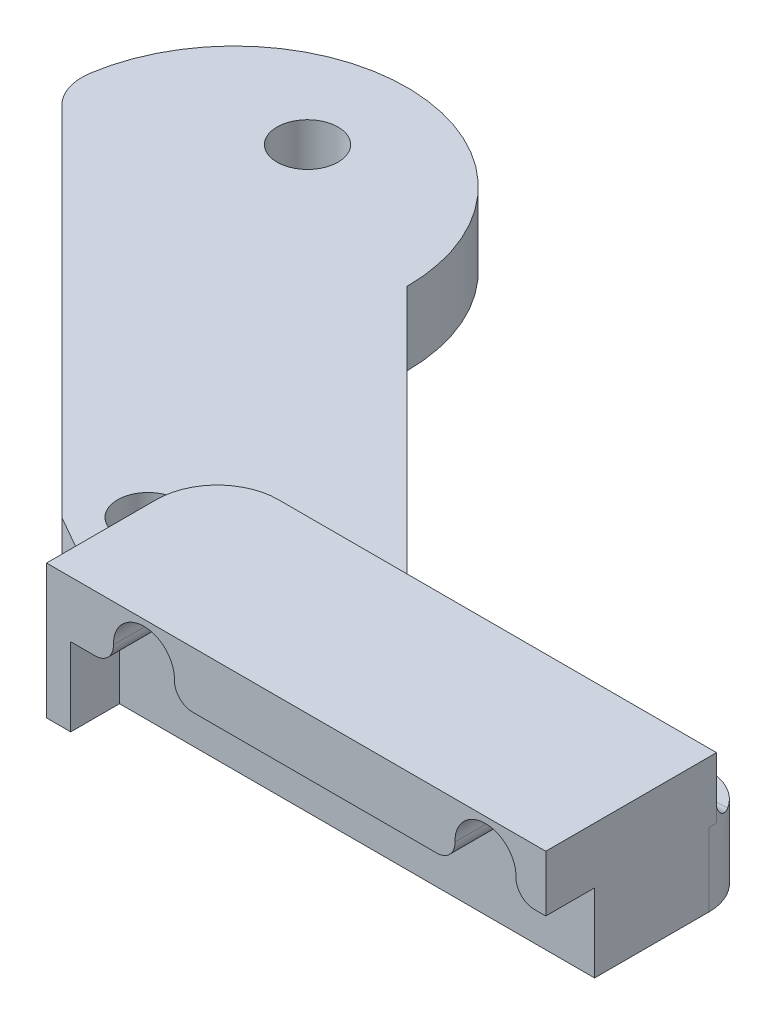
ISO-10303-21;
HEADER;
FILE_DESCRIPTION(('STEP AP214'),'2;1');
FILE_NAME('part.step','',(''),(''),'','','');
FILE_SCHEMA(('AUTOMOTIVE_DESIGN { 1 0 10303 214 1 1 1 1 }'));
ENDSEC;
DATA;
#1=APPLICATION_CONTEXT('core data for automotive mechanical design processes');
#2=APPLICATION_PROTOCOL_DEFINITION('international standard','automotive_design',2000,#1);
#3=PRODUCT_CONTEXT('',#1,'mechanical');
#4=PRODUCT('Part','Part','',(#3));
#5=PRODUCT_RELATED_PRODUCT_CATEGORY('part','',(#4));
#6=PRODUCT_DEFINITION_FORMATION('','',#4);
#7=PRODUCT_DEFINITION_CONTEXT('part definition',#1,'design');
#8=PRODUCT_DEFINITION('design','',#6,#7);
#9=PRODUCT_DEFINITION_SHAPE('','',#8);
#10=(LENGTH_UNIT() NAMED_UNIT(*) SI_UNIT(.MILLI.,.METRE.));
#11=(NAMED_UNIT(*) PLANE_ANGLE_UNIT() SI_UNIT($,.RADIAN.));
#12=(NAMED_UNIT(*) SI_UNIT($,.STERADIAN.) SOLID_ANGLE_UNIT());
#13=UNCERTAINTY_MEASURE_WITH_UNIT(LENGTH_MEASURE(1.E-05),#10,'distance_accuracy_value','');
#14=(GEOMETRIC_REPRESENTATION_CONTEXT(3) GLOBAL_UNCERTAINTY_ASSIGNED_CONTEXT((#13)) GLOBAL_UNIT_ASSIGNED_CONTEXT((#10,
#11,#12)) REPRESENTATION_CONTEXT('',''));
#15=CARTESIAN_POINT('',(0.,0.,0.));
#16=DIRECTION('',(0.,0.,1.));
#17=DIRECTION('',(1.,0.,0.));
#18=AXIS2_PLACEMENT_3D('',#15,#16,#17);
#19=CARTESIAN_POINT('',(0.,3.81,10.668));
#20=DIRECTION('',(0.,0.,-1.));
#21=DIRECTION('',(-1.,0.,0.));
#22=AXIS2_PLACEMENT_3D('',#19,#20,#21);
#23=PLANE('',#22);
#24=CARTESIAN_POINT('',(50.8759481826122,6.35,10.668));
#25=DIRECTION('',(0.,0.,1.));
#26=DIRECTION('',(1.,0.,0.));
#27=AXIS2_PLACEMENT_3D('',#24,#25,#26);
#28=CIRCLE('',#27,2.28599999999999);
#29=CARTESIAN_POINT('',(53.1619481826122,6.35,10.668));
#30=VERTEX_POINT('',#29);
#31=EDGE_CURVE('E322',#30,#30,#28,.T.);
#32=ORIENTED_EDGE('',*,*,#31,.F.);
#33=EDGE_LOOP('',(#32));
#34=FACE_BOUND('',#33,.T.);
#35=CARTESIAN_POINT('',(15.3159481826123,6.35,10.668));
#36=DIRECTION('',(0.,0.,1.));
#37=DIRECTION('',(1.,0.,0.));
#38=AXIS2_PLACEMENT_3D('',#35,#36,#37);
#39=CIRCLE('',#38,2.286);
#40=CARTESIAN_POINT('',(17.6019481826123,6.35,10.668));
#41=VERTEX_POINT('',#40);
#42=EDGE_CURVE('E318',#41,#41,#39,.T.);
#43=ORIENTED_EDGE('',*,*,#42,.F.);
#44=EDGE_LOOP('',(#43));
#45=FACE_BOUND('',#44,.T.);
#46=DIRECTION('',(1.,0.,0.));
#47=VECTOR('',#46,1.);
#48=CARTESIAN_POINT('',(0.,4.318,10.668));
#49=LINE('',#48,#47);
#50=CARTESIAN_POINT('',(55.9543604344878,4.318,10.668));
#51=VERTEX_POINT('',#50);
#52=CARTESIAN_POINT('',(57.15,4.318,10.668));
#53=VERTEX_POINT('',#52);
#54=EDGE_CURVE('E296',#51,#53,#49,.T.);
#55=ORIENTED_EDGE('',*,*,#54,.F.);
#56=CARTESIAN_POINT('',(55.9543604344878,6.223,10.668));
#57=DIRECTION('',(0.,0.,-1.));
#58=DIRECTION('',(-1.,0.,0.));
#59=AXIS2_PLACEMENT_3D('',#56,#57,#58);
#60=CIRCLE('',#59,1.905);
#61=CARTESIAN_POINT('',(54.0499558400345,6.270625,10.668));
#62=VERTEX_POINT('',#61);
#63=EDGE_CURVE('E514',#51,#62,#60,.T.);
#64=ORIENTED_EDGE('',*,*,#63,.T.);
#65=CARTESIAN_POINT('',(50.8759481826122,6.35,10.668));
#66=DIRECTION('',(0.,0.,1.));
#67=DIRECTION('',(1.,0.,0.));
#68=AXIS2_PLACEMENT_3D('',#65,#66,#67);
#69=CIRCLE('',#68,3.175);
#70=CARTESIAN_POINT('',(47.70194052519,6.270625,10.668));
#71=VERTEX_POINT('',#70);
#72=EDGE_CURVE('E292',#62,#71,#69,.T.);
#73=ORIENTED_EDGE('',*,*,#72,.T.);
#74=CARTESIAN_POINT('',(45.7975359307367,6.223,10.668));
#75=DIRECTION('',(0.,0.,-1.));
#76=DIRECTION('',(-1.,0.,0.));
#77=AXIS2_PLACEMENT_3D('',#74,#75,#76);
#78=CIRCLE('',#77,1.905);
#79=CARTESIAN_POINT('',(45.7975359307367,4.318,10.668));
#80=VERTEX_POINT('',#79);
#81=EDGE_CURVE('E517',#71,#80,#78,.T.);
#82=ORIENTED_EDGE('',*,*,#81,.T.);
#83=CARTESIAN_POINT('',(20.3943604344878,4.318,10.668));
#84=VERTEX_POINT('',#83);
#85=EDGE_CURVE('E276',#84,#80,#49,.T.);
#86=ORIENTED_EDGE('',*,*,#85,.F.);
#87=CARTESIAN_POINT('',(20.3943604344878,6.223,10.668));
#88=DIRECTION('',(0.,0.,-1.));
#89=DIRECTION('',(-1.,0.,0.));
#90=AXIS2_PLACEMENT_3D('',#87,#88,#89);
#91=CIRCLE('',#90,1.905);
#92=CARTESIAN_POINT('',(18.4899558400345,6.270625,10.668));
#93=VERTEX_POINT('',#92);
#94=EDGE_CURVE('E520',#84,#93,#91,.T.);
#95=ORIENTED_EDGE('',*,*,#94,.T.);
#96=CARTESIAN_POINT('',(15.3159481826123,6.35,10.668));
#97=DIRECTION('',(0.,0.,1.));
#98=DIRECTION('',(1.,0.,0.));
#99=AXIS2_PLACEMENT_3D('',#96,#97,#98);
#100=CIRCLE('',#99,3.175);
#101=CARTESIAN_POINT('',(12.14194052519,6.270625,10.668));
#102=VERTEX_POINT('',#101);
#103=EDGE_CURVE('E300',#93,#102,#100,.T.);
#104=ORIENTED_EDGE('',*,*,#103,.T.);
#105=CARTESIAN_POINT('',(10.2375359307367,6.223,10.668));
#106=DIRECTION('',(0.,0.,-1.));
#107=DIRECTION('',(-1.,0.,0.));
#108=AXIS2_PLACEMENT_3D('',#105,#106,#107);
#109=CIRCLE('',#108,1.905);
#110=CARTESIAN_POINT('',(10.2375359307367,4.318,10.668));
#111=VERTEX_POINT('',#110);
#112=EDGE_CURVE('E523',#102,#111,#109,.T.);
#113=ORIENTED_EDGE('',*,*,#112,.T.);
#114=CARTESIAN_POINT('',(7.69594818261226,4.318,10.668));
#115=VERTEX_POINT('',#114);
#116=EDGE_CURVE('E301',#115,#111,#49,.T.);
#117=ORIENTED_EDGE('',*,*,#116,.F.);
#118=DIRECTION('',(0.,-1.,0.));
#119=VECTOR('',#118,1.);
#120=CARTESIAN_POINT('',(7.69594818261226,3.81,10.668));
#121=LINE('',#120,#119);
#122=CARTESIAN_POINT('',(7.69594818261226,-3.81,10.668));
#123=VERTEX_POINT('',#122);
#124=EDGE_CURVE('E455',#115,#123,#121,.T.);
#125=ORIENTED_EDGE('',*,*,#124,.T.);
#126=DIRECTION('',(1.,0.,0.));
#127=VECTOR('',#126,1.);
#128=CARTESIAN_POINT('',(0.,-3.81,10.668));
#129=LINE('',#128,#127);
#130=CARTESIAN_POINT('',(57.15,-3.81,10.668));
#131=VERTEX_POINT('',#130);
#132=EDGE_CURVE('E397',#123,#131,#129,.T.);
#133=ORIENTED_EDGE('',*,*,#132,.T.);
#134=DIRECTION('',(0.,-1.,0.));
#135=VECTOR('',#134,1.);
#136=CARTESIAN_POINT('',(57.15,3.81,10.668));
#137=LINE('',#136,#135);
#138=EDGE_CURVE('E421',#53,#131,#137,.T.);
#139=ORIENTED_EDGE('',*,*,#138,.F.);
#140=EDGE_LOOP('',(#55,#64,#73,#82,#86,#95,#104,#113,#117,#125,#133,#139));
#141=FACE_BOUND('',#140,.T.);
#142=ADVANCED_FACE('F45',(#34,#45,#141),#23,.F.);
#143=CARTESIAN_POINT('',(-4.49012806053458,3.81,4.49012806053458));
#144=DIRECTION('',(-0.707106781186547,0.,0.707106781186548));
#145=DIRECTION('',(0.707106781186548,0.,0.707106781186547));
#146=AXIS2_PLACEMENT_3D('',#143,#144,#145);
#147=PLANE('',#146);
#148=DIRECTION('',(-0.707106781186548,0.,-0.707106781186547));
#149=VECTOR('',#148,1.);
#150=CARTESIAN_POINT('',(-4.49012806053458,3.81,4.49012806053458));
#151=LINE('',#150,#149);
#152=CARTESIAN_POINT('',(-4.49012806053458,3.81,4.49012806053458));
#153=VERTEX_POINT('',#152);
#154=CARTESIAN_POINT('',(-41.6331326972851,3.81,-32.6528765762159));
#155=VERTEX_POINT('',#154);
#156=EDGE_CURVE('E366',#153,#155,#151,.T.);
#157=ORIENTED_EDGE('',*,*,#156,.T.);
#158=DIRECTION('',(0.,-1.,0.));
#159=VECTOR('',#158,1.);
#160=CARTESIAN_POINT('',(-41.6331326972851,3.81,-32.6528765762159));
#161=LINE('',#160,#159);
#162=CARTESIAN_POINT('',(-41.6331326972851,-3.81,-32.6528765762159));
#163=VERTEX_POINT('',#162);
#164=EDGE_CURVE('E461',#155,#163,#161,.T.);
#165=ORIENTED_EDGE('',*,*,#164,.T.);
#166=DIRECTION('',(-0.707106781186548,0.,-0.707106781186547));
#167=VECTOR('',#166,1.);
#168=CARTESIAN_POINT('',(-4.49012806053458,-3.81,4.49012806053458));
#169=LINE('',#168,#167);
#170=CARTESIAN_POINT('',(-4.49012806053458,-3.81,4.49012806053458));
#171=VERTEX_POINT('',#170);
#172=EDGE_CURVE('E362',#171,#163,#169,.T.);
#173=ORIENTED_EDGE('',*,*,#172,.F.);
#174=DIRECTION('',(0.,-1.,0.));
#175=VECTOR('',#174,1.);
#176=CARTESIAN_POINT('',(-4.49012806053458,3.81,4.49012806053458));
#177=LINE('',#176,#175);
#178=EDGE_CURVE('E424',#153,#171,#177,.T.);
#179=ORIENTED_EDGE('',*,*,#178,.F.);
#180=EDGE_LOOP('',(#157,#165,#173,#179));
#181=FACE_BOUND('',#180,.T.);
#182=ADVANCED_FACE('F558',(#181),#147,.T.);
#183=CARTESIAN_POINT('',(-3.03241565510238,3.81,5.32088951603034));
#184=DIRECTION('',(0.49514248555653,0.,-0.868811785714778));
#185=DIRECTION('',(-0.868811785714778,0.,-0.49514248555653));
#186=AXIS2_PLACEMENT_3D('',#183,#184,#185);
#187=PLANE('',#186);
#188=DIRECTION('',(0.868811785714778,0.,0.49514248555653));
#189=VECTOR('',#188,1.);
#190=CARTESIAN_POINT('',(-3.03241565510238,-3.81,5.32088951603034));
#191=LINE('',#190,#189);
#192=CARTESIAN_POINT('',(5.18062435598509,-3.81,10.0015638714311));
#193=VERTEX_POINT('',#192);
#194=EDGE_CURVE('E394',#171,#193,#191,.T.);
#195=ORIENTED_EDGE('',*,*,#194,.T.);
#196=DIRECTION('',(0.,-1.,0.));
#197=VECTOR('',#196,1.);
#198=CARTESIAN_POINT('',(5.18062435598509,3.81,10.0015638714311));
#199=LINE('',#198,#197);
#200=CARTESIAN_POINT('',(5.18062435598509,5.715,10.0015638714311));
#201=VERTEX_POINT('',#200);
#202=EDGE_CURVE('E263',#193,#201,#199,.F.);
#203=ORIENTED_EDGE('',*,*,#202,.T.);
#204=CARTESIAN_POINT('',(3.27562435598509,5.715,8.91588979277068));
#205=DIRECTION('',(0.49514248555653,0.,-0.868811785714778));
#206=DIRECTION('',(0.868811785714778,0.,0.49514248555653));
#207=AXIS2_PLACEMENT_3D('',#204,#205,#206);
#208=ELLIPSE('',#207,2.19264981359886,1.905);
#209=CARTESIAN_POINT('',(3.27562435598509,3.81,8.91588979277068));
#210=VERTEX_POINT('',#209);
#211=EDGE_CURVE('E56',#201,#210,#208,.T.);
#212=ORIENTED_EDGE('',*,*,#211,.T.);
#213=DIRECTION('',(0.868811785714778,0.,0.49514248555653));
#214=VECTOR('',#213,1.);
#215=CARTESIAN_POINT('',(-3.03241565510238,3.81,5.32088951603034));
#216=LINE('',#215,#214);
#217=EDGE_CURVE('E370',#153,#210,#216,.T.);
#218=ORIENTED_EDGE('',*,*,#217,.F.);
#219=ORIENTED_EDGE('',*,*,#178,.T.);
#220=EDGE_LOOP('',(#195,#203,#212,#218,#219));
#221=FACE_BOUND('',#220,.T.);
#222=ADVANCED_FACE('F602',(#221),#187,.F.);
#223=CARTESIAN_POINT('',(57.15,3.81,0.));
#224=DIRECTION('',(1.,0.,0.));
#225=DIRECTION('',(0.,0.,-1.));
#226=AXIS2_PLACEMENT_3D('',#223,#224,#225);
#227=PLANE('',#226);
#228=DIRECTION('',(0.,0.,1.));
#229=VECTOR('',#228,1.);
#230=CARTESIAN_POINT('',(57.15,-3.81,0.));
#231=LINE('',#230,#229);
#232=CARTESIAN_POINT('',(57.15,-3.81,-1.26999999999974));
#233=VERTEX_POINT('',#232);
#234=EDGE_CURVE('E401',#233,#131,#231,.T.);
#235=ORIENTED_EDGE('',*,*,#234,.F.);
#236=DIRECTION('',(0.,-1.,0.));
#237=VECTOR('',#236,1.);
#238=CARTESIAN_POINT('',(57.15,3.81,-1.26999999999974));
#239=LINE('',#238,#237);
#240=CARTESIAN_POINT('',(57.15,3.81,-1.26999999999974));
#241=VERTEX_POINT('',#240);
#242=EDGE_CURVE('E440',#233,#241,#239,.F.);
#243=ORIENTED_EDGE('',*,*,#242,.T.);
#244=DIRECTION('',(0.,0.,-1.));
#245=VECTOR('',#244,1.);
#246=CARTESIAN_POINT('',(57.15,3.81,10.668));
#247=LINE('',#246,#245);
#248=CARTESIAN_POINT('',(57.15,3.81,-2.032));
#249=VERTEX_POINT('',#248);
#250=EDGE_CURVE('E317',#241,#249,#247,.T.);
#251=ORIENTED_EDGE('',*,*,#250,.T.);
#252=DIRECTION('',(0.,-1.,0.));
#253=VECTOR('',#252,1.);
#254=CARTESIAN_POINT('',(57.15,10.16,-2.032));
#255=LINE('',#254,#253);
#256=CARTESIAN_POINT('',(57.15,10.16,-2.032));
#257=VERTEX_POINT('',#256);
#258=EDGE_CURVE('E353',#257,#249,#255,.T.);
#259=ORIENTED_EDGE('',*,*,#258,.F.);
#260=DIRECTION('',(0.,0.,-1.));
#261=VECTOR('',#260,1.);
#262=CARTESIAN_POINT('',(57.15,10.16,10.668));
#263=LINE('',#262,#261);
#264=CARTESIAN_POINT('',(57.15,10.16,15.748));
#265=VERTEX_POINT('',#264);
#266=EDGE_CURVE('E329',#265,#257,#263,.T.);
#267=ORIENTED_EDGE('',*,*,#266,.F.);
#268=DIRECTION('',(0.,1.,0.));
#269=VECTOR('',#268,1.);
#270=CARTESIAN_POINT('',(57.15,0.,15.748));
#271=LINE('',#270,#269);
#272=CARTESIAN_POINT('',(57.15,4.318,15.748));
#273=VERTEX_POINT('',#272);
#274=EDGE_CURVE('E284',#273,#265,#271,.T.);
#275=ORIENTED_EDGE('',*,*,#274,.F.);
#276=DIRECTION('',(0.,0.,-1.));
#277=VECTOR('',#276,1.);
#278=CARTESIAN_POINT('',(57.15,4.318,15.748));
#279=LINE('',#278,#277);
#280=EDGE_CURVE('E308',#273,#53,#279,.T.);
#281=ORIENTED_EDGE('',*,*,#280,.T.);
#282=ORIENTED_EDGE('',*,*,#138,.T.);
#283=EDGE_LOOP('',(#235,#243,#251,#259,#267,#275,#281,#282));
#284=FACE_BOUND('',#283,.T.);
#285=ADVANCED_FACE('F607',(#284),#227,.T.);
#286=CARTESIAN_POINT('',(0.,3.81,-6.35));
#287=DIRECTION('',(0.,0.,-1.));
#288=DIRECTION('',(-1.,0.,0.));
#289=AXIS2_PLACEMENT_3D('',#286,#287,#288);
#290=PLANE('',#289);
#291=DIRECTION('',(1.,0.,0.));
#292=VECTOR('',#291,1.);
#293=CARTESIAN_POINT('',(0.,3.81,-6.35));
#294=LINE('',#293,#292);
#295=CARTESIAN_POINT('',(22.6949732600629,3.81,-6.34999999999989));
#296=VERTEX_POINT('',#295);
#297=CARTESIAN_POINT('',(52.07,3.81,-6.34999999999974));
#298=VERTEX_POINT('',#297);
#299=EDGE_CURVE('E375',#296,#298,#294,.T.);
#300=ORIENTED_EDGE('',*,*,#299,.T.);
#301=DIRECTION('',(0.,-1.,0.));
#302=VECTOR('',#301,1.);
#303=CARTESIAN_POINT('',(52.07,3.81,-6.34999999999974));
#304=LINE('',#303,#302);
#305=CARTESIAN_POINT('',(52.07,-3.81,-6.34999999999974));
#306=VERTEX_POINT('',#305);
#307=EDGE_CURVE('E430',#298,#306,#304,.T.);
#308=ORIENTED_EDGE('',*,*,#307,.T.);
#309=DIRECTION('',(1.,0.,0.));
#310=VECTOR('',#309,1.);
#311=CARTESIAN_POINT('',(0.,-3.81,-6.35));
#312=LINE('',#311,#310);
#313=CARTESIAN_POINT('',(22.6949732600629,-3.81,-6.34999999999989));
#314=VERTEX_POINT('',#313);
#315=EDGE_CURVE('E405',#314,#306,#312,.T.);
#316=ORIENTED_EDGE('',*,*,#315,.F.);
#317=DIRECTION('',(0.,-1.,0.));
#318=VECTOR('',#317,1.);
#319=CARTESIAN_POINT('',(22.6949732600629,3.81,-6.34999999999989));
#320=LINE('',#319,#318);
#321=EDGE_CURVE('E427',#314,#296,#320,.F.);
#322=ORIENTED_EDGE('',*,*,#321,.T.);
#323=EDGE_LOOP('',(#300,#308,#316,#322));
#324=FACE_BOUND('',#323,.T.);
#325=ADVANCED_FACE('F614',(#324),#290,.T.);
#326=CARTESIAN_POINT('',(13.4703841816037,3.81,-13.4703841816037));
#327=DIRECTION('',(-0.707106781186547,0.,0.707106781186548));
#328=DIRECTION('',(0.707106781186548,0.,0.707106781186547));
#329=AXIS2_PLACEMENT_3D('',#326,#327,#328);
#330=PLANE('',#329);
#331=DIRECTION('',(-0.707106781186548,0.,-0.707106781186547));
#332=VECTOR('',#331,1.);
#333=CARTESIAN_POINT('',(13.4703841816037,3.81,-13.4703841816037));
#334=LINE('',#333,#332);
#335=CARTESIAN_POINT('',(19.1028708116352,3.81,-7.83789755157222));
#336=VERTEX_POINT('',#335);
#337=CARTESIAN_POINT('',(-7.34923163679256,3.81,-34.29));
#338=VERTEX_POINT('',#337);
#339=EDGE_CURVE('E379',#336,#338,#334,.T.);
#340=ORIENTED_EDGE('',*,*,#339,.F.);
#341=DIRECTION('',(0.,-1.,0.));
#342=VECTOR('',#341,1.);
#343=CARTESIAN_POINT('',(19.1028708116352,3.81,-7.83789755157222));
#344=LINE('',#343,#342);
#345=CARTESIAN_POINT('',(19.1028708116352,-3.81,-7.83789755157222));
#346=VERTEX_POINT('',#345);
#347=EDGE_CURVE('E451',#336,#346,#344,.T.);
#348=ORIENTED_EDGE('',*,*,#347,.T.);
#349=DIRECTION('',(-0.707106781186548,0.,-0.707106781186547));
#350=VECTOR('',#349,1.);
#351=CARTESIAN_POINT('',(13.4703841816037,-3.81,-13.4703841816037));
#352=LINE('',#351,#350);
#353=CARTESIAN_POINT('',(-7.34923163679256,-3.81,-34.29));
#354=VERTEX_POINT('',#353);
#355=EDGE_CURVE('E408',#346,#354,#352,.T.);
#356=ORIENTED_EDGE('',*,*,#355,.T.);
#357=DIRECTION('',(0.,-1.,0.));
#358=VECTOR('',#357,1.);
#359=CARTESIAN_POINT('',(-7.34923163679256,3.81,-34.29));
#360=LINE('',#359,#358);
#361=EDGE_CURVE('E390',#338,#354,#360,.T.);
#362=ORIENTED_EDGE('',*,*,#361,.F.);
#363=EDGE_LOOP('',(#340,#348,#356,#362));
#364=FACE_BOUND('',#363,.T.);
#365=ADVANCED_FACE('F631',(#364),#330,.F.);
#366=CARTESIAN_POINT('',(-25.3097438789309,3.81,-34.29));
#367=DIRECTION('',(0.,-1.,0.));
#368=DIRECTION('',(0.,0.,-1.));
#369=AXIS2_PLACEMENT_3D('',#366,#367,#368);
#370=CYLINDRICAL_SURFACE('',#369,17.9605122421383);
#371=CARTESIAN_POINT('',(-25.3097438789309,-3.81,-34.29));
#372=DIRECTION('',(0.,1.,0.));
#373=DIRECTION('',(0.,0.,1.));
#374=AXIS2_PLACEMENT_3D('',#371,#372,#373);
#375=CIRCLE('',#374,17.9605122421383);
#376=CARTESIAN_POINT('',(-43.0621764225045,-3.81,-37.0160115160921));
#377=VERTEX_POINT('',#376);
#378=EDGE_CURVE('E411',#377,#354,#375,.F.);
#379=ORIENTED_EDGE('',*,*,#378,.F.);
#380=DIRECTION('',(0.,-1.,0.));
#381=VECTOR('',#380,1.);
#382=CARTESIAN_POINT('',(-43.0621764225045,3.81,-37.0160115160921));
#383=LINE('',#382,#381);
#384=CARTESIAN_POINT('',(-43.0621764225045,3.81,-37.0160115160921));
#385=VERTEX_POINT('',#384);
#386=EDGE_CURVE('E465',#377,#385,#383,.F.);
#387=ORIENTED_EDGE('',*,*,#386,.T.);
#388=CARTESIAN_POINT('',(-25.3097438789309,3.81,-34.29));
#389=DIRECTION('',(0.,1.,0.));
#390=DIRECTION('',(0.,0.,1.));
#391=AXIS2_PLACEMENT_3D('',#388,#389,#390);
#392=CIRCLE('',#391,17.9605122421383);
#393=EDGE_CURVE('E383',#385,#338,#392,.F.);
#394=ORIENTED_EDGE('',*,*,#393,.T.);
#395=ORIENTED_EDGE('',*,*,#361,.T.);
#396=EDGE_LOOP('',(#379,#387,#394,#395));
#397=FACE_BOUND('',#396,.T.);
#398=ADVANCED_FACE('F626',(#397),#370,.T.);
#399=CARTESIAN_POINT('',(0.,3.81,0.));
#400=DIRECTION('',(0.,-1.,0.));
#401=DIRECTION('',(0.,0.,-1.));
#402=AXIS2_PLACEMENT_3D('',#399,#400,#401);
#403=CYLINDRICAL_SURFACE('',#402,3.175);
#404=CARTESIAN_POINT('',(0.,3.81,0.));
#405=DIRECTION('',(0.,1.,0.));
#406=DIRECTION('',(0.,0.,1.));
#407=AXIS2_PLACEMENT_3D('',#404,#405,#406);
#408=CIRCLE('',#407,3.175);
#409=CARTESIAN_POINT('',(0.,3.81,3.175));
#410=VERTEX_POINT('',#409);
#411=EDGE_CURVE('E386',#410,#410,#408,.T.);
#412=ORIENTED_EDGE('',*,*,#411,.T.);
#413=EDGE_LOOP('',(#412));
#414=FACE_BOUND('',#413,.T.);
#415=CARTESIAN_POINT('',(0.,-3.81,0.));
#416=DIRECTION('',(0.,1.,0.));
#417=DIRECTION('',(0.,0.,1.));
#418=AXIS2_PLACEMENT_3D('',#415,#416,#417);
#419=CIRCLE('',#418,3.175);
#420=CARTESIAN_POINT('',(0.,-3.81,3.175));
#421=VERTEX_POINT('',#420);
#422=EDGE_CURVE('E371',#421,#421,#419,.T.);
#423=ORIENTED_EDGE('',*,*,#422,.F.);
#424=EDGE_LOOP('',(#423));
#425=FACE_BOUND('',#424,.T.);
#426=ADVANCED_FACE('F707',(#414,#425),#403,.F.);
#427=CARTESIAN_POINT('',(0.,3.81,0.));
#428=DIRECTION('',(0.,1.,0.));
#429=DIRECTION('',(0.,0.,1.));
#430=AXIS2_PLACEMENT_3D('',#427,#428,#429);
#431=PLANE('',#430);
#432=ORIENTED_EDGE('',*,*,#217,.T.);
#433=DIRECTION('',(0.,0.,1.));
#434=VECTOR('',#433,1.);
#435=CARTESIAN_POINT('',(3.27562435598509,3.81,0.));
#436=LINE('',#435,#434);
#437=CARTESIAN_POINT('',(3.27562435598509,3.81,4.318));
#438=VERTEX_POINT('',#437);
#439=EDGE_CURVE('E535',#210,#438,#436,.F.);
#440=ORIENTED_EDGE('',*,*,#439,.T.);
#441=CARTESIAN_POINT('',(11.5306243559851,3.81,4.318));
#442=DIRECTION('',(0.,1.,0.));
#443=DIRECTION('',(0.,0.,1.));
#444=AXIS2_PLACEMENT_3D('',#441,#442,#443);
#445=CIRCLE('',#444,8.255);
#446=CARTESIAN_POINT('',(11.5306243559851,3.81,-3.937));
#447=VERTEX_POINT('',#446);
#448=EDGE_CURVE('E532',#438,#447,#445,.F.);
#449=ORIENTED_EDGE('',*,*,#448,.T.);
#450=DIRECTION('',(-1.,0.,0.));
#451=VECTOR('',#450,1.);
#452=CARTESIAN_POINT('',(0.,3.81,-3.937));
#453=LINE('',#452,#451);
#454=CARTESIAN_POINT('',(56.3935993107593,3.81,-3.937));
#455=VERTEX_POINT('',#454);
#456=EDGE_CURVE('E529',#447,#455,#453,.F.);
#457=ORIENTED_EDGE('',*,*,#456,.T.);
#458=CARTESIAN_POINT('',(52.07,3.81,-1.26999999999974));
#459=DIRECTION('',(0.,1.,0.));
#460=DIRECTION('',(0.,0.,1.));
#461=AXIS2_PLACEMENT_3D('',#458,#459,#460);
#462=CIRCLE('',#461,5.08);
#463=EDGE_CURVE('E446',#455,#298,#462,.T.);
#464=ORIENTED_EDGE('',*,*,#463,.T.);
#465=ORIENTED_EDGE('',*,*,#299,.F.);
#466=CARTESIAN_POINT('',(22.6949732600629,3.81,-11.4299999999999));
#467=DIRECTION('',(0.,1.,0.));
#468=DIRECTION('',(0.,0.,1.));
#469=AXIS2_PLACEMENT_3D('',#466,#467,#468);
#470=CIRCLE('',#469,5.08);
#471=EDGE_CURVE('E471',#296,#336,#470,.F.);
#472=ORIENTED_EDGE('',*,*,#471,.T.);
#473=ORIENTED_EDGE('',*,*,#339,.T.);
#474=ORIENTED_EDGE('',*,*,#393,.F.);
#475=CARTESIAN_POINT('',(-38.0410302488575,3.81,-36.2449790246436));
#476=DIRECTION('',(0.,1.,0.));
#477=DIRECTION('',(0.,0.,1.));
#478=AXIS2_PLACEMENT_3D('',#475,#476,#477);
#479=CIRCLE('',#478,5.08);
#480=EDGE_CURVE('E443',#385,#155,#479,.T.);
#481=ORIENTED_EDGE('',*,*,#480,.T.);
#482=ORIENTED_EDGE('',*,*,#156,.F.);
#483=EDGE_LOOP('',(#432,#440,#449,#457,#464,#465,#472,#473,#474,#481,#482));
#484=FACE_BOUND('',#483,.T.);
#485=CARTESIAN_POINT('',(-25.3097438789309,3.81,-41.91));
#486=DIRECTION('',(0.,1.,0.));
#487=DIRECTION('',(0.,0.,1.));
#488=AXIS2_PLACEMENT_3D('',#485,#486,#487);
#489=CIRCLE('',#488,3.175);
#490=CARTESIAN_POINT('',(-25.3097438789309,3.81,-38.735));
#491=VERTEX_POINT('',#490);
#492=EDGE_CURVE('E357',#491,#491,#489,.T.);
#493=ORIENTED_EDGE('',*,*,#492,.F.);
#494=EDGE_LOOP('',(#493));
#495=FACE_BOUND('',#494,.T.);
#496=ORIENTED_EDGE('',*,*,#411,.F.);
#497=EDGE_LOOP('',(#496));
#498=FACE_BOUND('',#497,.T.);
#499=ADVANCED_FACE('F640',(#484,#495,#498),#431,.T.);
#500=CARTESIAN_POINT('',(0.,-3.81,0.));
#501=DIRECTION('',(0.,1.,0.));
#502=DIRECTION('',(0.,0.,1.));
#503=AXIS2_PLACEMENT_3D('',#500,#501,#502);
#504=PLANE('',#503);
#505=CARTESIAN_POINT('',(-25.3097438789309,-3.81,-41.91));
#506=DIRECTION('',(0.,1.,0.));
#507=DIRECTION('',(0.,0.,1.));
#508=AXIS2_PLACEMENT_3D('',#505,#506,#507);
#509=CIRCLE('',#508,3.175);
#510=CARTESIAN_POINT('',(-25.3097438789309,-3.81,-38.735));
#511=VERTEX_POINT('',#510);
#512=EDGE_CURVE('E358',#511,#511,#509,.T.);
#513=ORIENTED_EDGE('',*,*,#512,.T.);
#514=EDGE_LOOP('',(#513));
#515=FACE_BOUND('',#514,.T.);
#516=ORIENTED_EDGE('',*,*,#315,.T.);
#517=CARTESIAN_POINT('',(52.07,-3.81,-1.26999999999974));
#518=DIRECTION('',(0.,1.,0.));
#519=DIRECTION('',(0.,0.,1.));
#520=AXIS2_PLACEMENT_3D('',#517,#518,#519);
#521=CIRCLE('',#520,5.08);
#522=EDGE_CURVE('E437',#306,#233,#521,.F.);
#523=ORIENTED_EDGE('',*,*,#522,.T.);
#524=ORIENTED_EDGE('',*,*,#234,.T.);
#525=ORIENTED_EDGE('',*,*,#132,.F.);
#526=DIRECTION('',(0.,0.,1.));
#527=VECTOR('',#526,1.);
#528=CARTESIAN_POINT('',(7.69594818261226,-3.81,0.));
#529=LINE('',#528,#527);
#530=CARTESIAN_POINT('',(7.69594818261226,-3.81,15.748));
#531=VERTEX_POINT('',#530);
#532=EDGE_CURVE('E246',#123,#531,#529,.T.);
#533=ORIENTED_EDGE('',*,*,#532,.T.);
#534=DIRECTION('',(1.,0.,0.));
#535=VECTOR('',#534,1.);
#536=CARTESIAN_POINT('',(0.,-3.81,15.748));
#537=LINE('',#536,#535);
#538=CARTESIAN_POINT('',(5.18062435598509,-3.81,15.748));
#539=VERTEX_POINT('',#538);
#540=EDGE_CURVE('E237',#539,#531,#537,.T.);
#541=ORIENTED_EDGE('',*,*,#540,.F.);
#542=DIRECTION('',(0.,0.,1.));
#543=VECTOR('',#542,1.);
#544=CARTESIAN_POINT('',(5.18062435598509,-3.81,0.));
#545=LINE('',#544,#543);
#546=EDGE_CURVE('E255',#193,#539,#545,.T.);
#547=ORIENTED_EDGE('',*,*,#546,.F.);
#548=ORIENTED_EDGE('',*,*,#194,.F.);
#549=ORIENTED_EDGE('',*,*,#172,.T.);
#550=CARTESIAN_POINT('',(-38.0410302488575,-3.81,-36.2449790246436));
#551=DIRECTION('',(0.,1.,0.));
#552=DIRECTION('',(0.,0.,1.));
#553=AXIS2_PLACEMENT_3D('',#550,#551,#552);
#554=CIRCLE('',#553,5.08);
#555=EDGE_CURVE('E434',#163,#377,#554,.F.);
#556=ORIENTED_EDGE('',*,*,#555,.T.);
#557=ORIENTED_EDGE('',*,*,#378,.T.);
#558=ORIENTED_EDGE('',*,*,#355,.F.);
#559=CARTESIAN_POINT('',(22.6949732600629,-3.81,-11.4299999999999));
#560=DIRECTION('',(0.,1.,0.));
#561=DIRECTION('',(0.,0.,1.));
#562=AXIS2_PLACEMENT_3D('',#559,#560,#561);
#563=CIRCLE('',#562,5.08);
#564=EDGE_CURVE('E468',#346,#314,#563,.T.);
#565=ORIENTED_EDGE('',*,*,#564,.T.);
#566=EDGE_LOOP('',(#516,#523,#524,#525,#533,#541,#547,#548,#549,#556,#557,#558,#565));
#567=FACE_BOUND('',#566,.T.);
#568=ORIENTED_EDGE('',*,*,#422,.T.);
#569=EDGE_LOOP('',(#568));
#570=FACE_BOUND('',#569,.T.);
#571=ADVANCED_FACE('F252',(#515,#567,#570),#504,.F.);
#572=CARTESIAN_POINT('',(52.07,3.81,-1.26999999999974));
#573=DIRECTION('',(0.,-1.,0.));
#574=DIRECTION('',(0.,0.,-1.));
#575=AXIS2_PLACEMENT_3D('',#572,#573,#574);
#576=CYLINDRICAL_SURFACE('',#575,5.08);
#577=CARTESIAN_POINT('',(57.0925248630544,3.81,-2.032));
#578=VERTEX_POINT('',#577);
#579=EDGE_CURVE('E447',#241,#578,#462,.T.);
#580=ORIENTED_EDGE('',*,*,#579,.F.);
#581=ORIENTED_EDGE('',*,*,#242,.F.);
#582=ORIENTED_EDGE('',*,*,#522,.F.);
#583=ORIENTED_EDGE('',*,*,#307,.F.);
#584=ORIENTED_EDGE('',*,*,#463,.F.);
#585=CARTESIAN_POINT('',(56.3935993107593,3.81,-3.937));
#586=CARTESIAN_POINT('',(56.4241001729125,3.80999643664978,-3.88756823605637));
#587=CARTESIAN_POINT('',(56.4537481670744,3.81192460868966,-3.83759246390041));
#588=CARTESIAN_POINT('',(56.5112051270718,3.81986838079331,-3.73686871175604));
#589=CARTESIAN_POINT('',(56.5390127450003,3.82588694111893,-3.68612019854696));
#590=CARTESIAN_POINT('',(56.5926998401899,3.84226318902681,-3.58407058311564));
#591=CARTESIAN_POINT('',(56.6185726213898,3.85263519201191,-3.53276820688164));
#592=CARTESIAN_POINT('',(56.6681470227841,3.87787588585766,-3.43025335608895));
#593=CARTESIAN_POINT('',(56.6918491610381,3.89274350010345,-3.37904086295514));
#594=CARTESIAN_POINT('',(56.7597652656714,3.94447108314589,-3.22574948506354));
#595=CARTESIAN_POINT('',(56.8005830594338,3.98839605524037,-3.12441171803903));
#596=CARTESIAN_POINT('',(56.8727091615021,4.09489536461904,-2.92869791551139));
#597=CARTESIAN_POINT('',(56.9040384936164,4.15742785368534,-2.83430684488592));
#598=CARTESIAN_POINT('',(56.9555408876402,4.29341398795361,-2.6646525328465));
#599=CARTESIAN_POINT('',(56.9764593813122,4.36539762685703,-2.58843430262678));
#600=CARTESIAN_POINT('',(57.0120065801347,4.5218460422746,-2.44822711316366));
#601=CARTESIAN_POINT('',(57.0266317331254,4.60631783145211,-2.38424507169925));
#602=CARTESIAN_POINT('',(57.0504221684879,4.78277424839245,-2.27248860590495));
#603=CARTESIAN_POINT('',(57.0597250784914,4.87449218856772,-2.22432083615542));
#604=CARTESIAN_POINT('',(57.0745192025397,5.06475887269224,-2.14343222283384));
#605=CARTESIAN_POINT('',(57.0800123674796,5.16330409204795,-2.11070347599448));
#606=CARTESIAN_POINT('',(57.086932027875,5.33763154193296,-2.06820598431686));
#607=CARTESIAN_POINT('',(57.0890519230975,5.41248722539579,-2.05464398586165));
#608=CARTESIAN_POINT('',(57.0918363330355,5.56321986369539,-2.0365372340823));
#609=CARTESIAN_POINT('',(57.0925025303738,5.63909553541011,-2.03198205613935));
#610=CARTESIAN_POINT('',(57.0925248630544,5.715,-2.032));
#611=B_SPLINE_CURVE_WITH_KNOTS('',3,(#585,#586,#587,#588,#589,#590,#591,#592,#593,#594,#595,
#596,#597,#598,#599,#600,#601,#602,#603,#604,#605,#606,#607,#608,#609,#610),.UNSPECIFIED.,.F.,
.F.,(4,2,2,2,2,2,2,2,2,2,2,2,4),(0.,0.174234032677359,0.348594295025095,0.523532453572634,
0.698428750837528,1.04955126857992,1.39989000618109,1.71900565970583,2.03830119665158,
2.34891604159823,2.65937170916179,2.8871537765353,3.11467205110594),.UNSPECIFIED.);
#612=CARTESIAN_POINT('',(57.0925248630544,5.715,-2.032));
#613=VERTEX_POINT('',#612);
#614=EDGE_CURVE('E11',#455,#613,#611,.T.);
#615=ORIENTED_EDGE('',*,*,#614,.T.);
#616=DIRECTION('',(0.,-1.,0.));
#617=VECTOR('',#616,1.);
#618=CARTESIAN_POINT('',(57.0925248630544,3.81,-2.032));
#619=LINE('',#618,#617);
#620=EDGE_CURVE('E63',#578,#613,#619,.F.);
#621=ORIENTED_EDGE('',*,*,#620,.F.);
#622=EDGE_LOOP('',(#580,#581,#582,#583,#584,#615,#621));
#623=FACE_BOUND('',#622,.T.);
#624=ADVANCED_FACE('F552',(#623),#576,.T.);
#625=CARTESIAN_POINT('',(22.6949732600629,3.81,-11.4299999999999));
#626=DIRECTION('',(0.,-1.,0.));
#627=DIRECTION('',(0.,0.,-1.));
#628=AXIS2_PLACEMENT_3D('',#625,#626,#627);
#629=CYLINDRICAL_SURFACE('',#628,5.08);
#630=ORIENTED_EDGE('',*,*,#471,.F.);
#631=ORIENTED_EDGE('',*,*,#321,.F.);
#632=ORIENTED_EDGE('',*,*,#564,.F.);
#633=ORIENTED_EDGE('',*,*,#347,.F.);
#634=EDGE_LOOP('',(#630,#631,#632,#633));
#635=FACE_BOUND('',#634,.T.);
#636=ADVANCED_FACE('F557',(#635),#629,.F.);
#637=CARTESIAN_POINT('',(-38.0410302488575,3.81,-36.2449790246436));
#638=DIRECTION('',(0.,-1.,0.));
#639=DIRECTION('',(0.,0.,-1.));
#640=AXIS2_PLACEMENT_3D('',#637,#638,#639);
#641=CYLINDRICAL_SURFACE('',#640,5.08);
#642=ORIENTED_EDGE('',*,*,#480,.F.);
#643=ORIENTED_EDGE('',*,*,#386,.F.);
#644=ORIENTED_EDGE('',*,*,#555,.F.);
#645=ORIENTED_EDGE('',*,*,#164,.F.);
#646=EDGE_LOOP('',(#642,#643,#644,#645));
#647=FACE_BOUND('',#646,.T.);
#648=ADVANCED_FACE('F562',(#647),#641,.T.);
#649=CARTESIAN_POINT('',(-25.3097438789309,-3.81,-41.91));
#650=DIRECTION('',(0.,1.,0.));
#651=DIRECTION('',(0.,0.,1.));
#652=AXIS2_PLACEMENT_3D('',#649,#650,#651);
#653=CYLINDRICAL_SURFACE('',#652,3.175);
#654=ORIENTED_EDGE('',*,*,#512,.F.);
#655=EDGE_LOOP('',(#654));
#656=FACE_BOUND('',#655,.T.);
#657=ORIENTED_EDGE('',*,*,#492,.T.);
#658=EDGE_LOOP('',(#657));
#659=FACE_BOUND('',#658,.T.);
#660=ADVANCED_FACE('F566',(#656,#659),#653,.F.);
#661=CARTESIAN_POINT('',(7.69594818261226,3.81,5.588));
#662=DIRECTION('',(0.,1.,0.));
#663=DIRECTION('',(0.,0.,1.));
#664=AXIS2_PLACEMENT_3D('',#661,#662,#663);
#665=PLANE('',#664);
#666=ORIENTED_EDGE('',*,*,#250,.F.);
#667=ORIENTED_EDGE('',*,*,#579,.T.);
#668=DIRECTION('',(-1.,0.,0.));
#669=VECTOR('',#668,1.);
#670=CARTESIAN_POINT('',(57.15,3.81,-2.032));
#671=LINE('',#670,#669);
#672=EDGE_CURVE('E333',#249,#578,#671,.T.);
#673=ORIENTED_EDGE('',*,*,#672,.F.);
#674=EDGE_LOOP('',(#666,#667,#673));
#675=FACE_BOUND('',#674,.T.);
#676=ADVANCED_FACE('F698',(#675),#665,.F.);
#677=CARTESIAN_POINT('',(57.15,10.16,-2.032));
#678=DIRECTION('',(0.,0.,1.));
#679=DIRECTION('',(1.,0.,0.));
#680=AXIS2_PLACEMENT_3D('',#677,#678,#679);
#681=PLANE('',#680);
#682=ORIENTED_EDGE('',*,*,#620,.T.);
#683=DIRECTION('',(-1.,0.,0.));
#684=VECTOR('',#683,1.);
#685=CARTESIAN_POINT('',(57.15,5.715,-2.032));
#686=LINE('',#685,#684);
#687=CARTESIAN_POINT('',(11.5306243559851,5.715,-2.032));
#688=VERTEX_POINT('',#687);
#689=EDGE_CURVE('E543',#613,#688,#686,.T.);
#690=ORIENTED_EDGE('',*,*,#689,.T.);
#691=DIRECTION('',(0.,-1.,0.));
#692=VECTOR('',#691,1.);
#693=CARTESIAN_POINT('',(11.5306243559851,10.16,-2.032));
#694=LINE('',#693,#692);
#695=CARTESIAN_POINT('',(11.5306243559851,10.16,-2.032));
#696=VERTEX_POINT('',#695);
#697=EDGE_CURVE('E349',#696,#688,#694,.T.);
#698=ORIENTED_EDGE('',*,*,#697,.F.);
#699=DIRECTION('',(-1.,0.,0.));
#700=VECTOR('',#699,1.);
#701=CARTESIAN_POINT('',(57.15,10.16,-2.032));
#702=LINE('',#701,#700);
#703=EDGE_CURVE('E332',#257,#696,#702,.T.);
#704=ORIENTED_EDGE('',*,*,#703,.F.);
#705=ORIENTED_EDGE('',*,*,#258,.T.);
#706=ORIENTED_EDGE('',*,*,#672,.T.);
#707=EDGE_LOOP('',(#682,#690,#698,#704,#705,#706));
#708=FACE_BOUND('',#707,.T.);
#709=ADVANCED_FACE('F689',(#708),#681,.F.);
#710=CARTESIAN_POINT('',(11.5306243559851,10.16,4.318));
#711=DIRECTION('',(0.,-1.,0.));
#712=DIRECTION('',(0.,0.,-1.));
#713=AXIS2_PLACEMENT_3D('',#710,#711,#712);
#714=CYLINDRICAL_SURFACE('',#713,6.35);
#715=ORIENTED_EDGE('',*,*,#697,.T.);
#716=CARTESIAN_POINT('',(11.5306243559851,5.715,4.318));
#717=DIRECTION('',(0.,1.,0.));
#718=DIRECTION('',(0.,0.,1.));
#719=AXIS2_PLACEMENT_3D('',#716,#717,#718);
#720=CIRCLE('',#719,6.35);
#721=CARTESIAN_POINT('',(5.18062435598509,5.715,4.318));
#722=VERTEX_POINT('',#721);
#723=EDGE_CURVE('E538',#688,#722,#720,.T.);
#724=ORIENTED_EDGE('',*,*,#723,.T.);
#725=DIRECTION('',(0.,-1.,0.));
#726=VECTOR('',#725,1.);
#727=CARTESIAN_POINT('',(5.18062435598509,10.16,4.318));
#728=LINE('',#727,#726);
#729=CARTESIAN_POINT('',(5.18062435598509,10.16,4.318));
#730=VERTEX_POINT('',#729);
#731=EDGE_CURVE('E342',#730,#722,#728,.T.);
#732=ORIENTED_EDGE('',*,*,#731,.F.);
#733=CARTESIAN_POINT('',(11.5306243559851,10.16,4.318));
#734=DIRECTION('',(0.,1.,0.));
#735=DIRECTION('',(0.,0.,1.));
#736=AXIS2_PLACEMENT_3D('',#733,#734,#735);
#737=CIRCLE('',#736,6.35);
#738=EDGE_CURVE('E336',#696,#730,#737,.T.);
#739=ORIENTED_EDGE('',*,*,#738,.F.);
#740=EDGE_LOOP('',(#715,#724,#732,#739));
#741=FACE_BOUND('',#740,.T.);
#742=ADVANCED_FACE('F690',(#741),#714,.T.);
#743=CARTESIAN_POINT('',(5.18062435598509,10.16,10.0015638714311));
#744=DIRECTION('',(1.,0.,0.));
#745=DIRECTION('',(0.,0.,-1.));
#746=AXIS2_PLACEMENT_3D('',#743,#744,#745);
#747=PLANE('',#746);
#748=ORIENTED_EDGE('',*,*,#731,.T.);
#749=DIRECTION('',(0.,0.,1.));
#750=VECTOR('',#749,1.);
#751=CARTESIAN_POINT('',(5.18062435598509,5.715,10.0015638714311));
#752=LINE('',#751,#750);
#753=EDGE_CURVE('E526',#722,#201,#752,.T.);
#754=ORIENTED_EDGE('',*,*,#753,.T.);
#755=ORIENTED_EDGE('',*,*,#202,.F.);
#756=ORIENTED_EDGE('',*,*,#546,.T.);
#757=DIRECTION('',(0.,-1.,0.));
#758=VECTOR('',#757,1.);
#759=CARTESIAN_POINT('',(5.18062435598509,16.432828877988,15.748));
#760=LINE('',#759,#758);
#761=CARTESIAN_POINT('',(5.18062435598509,10.16,15.748));
#762=VERTEX_POINT('',#761);
#763=EDGE_CURVE('E233',#762,#539,#760,.T.);
#764=ORIENTED_EDGE('',*,*,#763,.F.);
#765=DIRECTION('',(0.,0.,1.));
#766=VECTOR('',#765,1.);
#767=CARTESIAN_POINT('',(5.18062435598509,10.16,10.0015638714311));
#768=LINE('',#767,#766);
#769=EDGE_CURVE('E339',#730,#762,#768,.T.);
#770=ORIENTED_EDGE('',*,*,#769,.F.);
#771=EDGE_LOOP('',(#748,#754,#755,#756,#764,#770));
#772=FACE_BOUND('',#771,.T.);
#773=ADVANCED_FACE('F261',(#772),#747,.F.);
#774=CARTESIAN_POINT('',(7.69594818261226,10.16,5.588));
#775=DIRECTION('',(0.,1.,0.));
#776=DIRECTION('',(0.,0.,1.));
#777=AXIS2_PLACEMENT_3D('',#774,#775,#776);
#778=PLANE('',#777);
#779=ORIENTED_EDGE('',*,*,#769,.T.);
#780=DIRECTION('',(-1.,0.,0.));
#781=VECTOR('',#780,1.);
#782=CARTESIAN_POINT('',(0.,10.16,15.748));
#783=LINE('',#782,#781);
#784=EDGE_CURVE('E240',#265,#762,#783,.T.);
#785=ORIENTED_EDGE('',*,*,#784,.F.);
#786=ORIENTED_EDGE('',*,*,#266,.T.);
#787=ORIENTED_EDGE('',*,*,#703,.T.);
#788=ORIENTED_EDGE('',*,*,#738,.T.);
#789=EDGE_LOOP('',(#779,#785,#786,#787,#788));
#790=FACE_BOUND('',#789,.T.);
#791=ADVANCED_FACE('F669',(#790),#778,.T.);
#792=CARTESIAN_POINT('',(50.8759481826122,6.35,4.318));
#793=DIRECTION('',(0.,0.,1.));
#794=DIRECTION('',(1.,0.,0.));
#795=AXIS2_PLACEMENT_3D('',#792,#793,#794);
#796=CYLINDRICAL_SURFACE('',#795,2.28599999999999);
#797=CARTESIAN_POINT('',(50.8759481826122,6.35,4.318));
#798=DIRECTION('',(0.,0.,1.));
#799=DIRECTION('',(1.,0.,0.));
#800=AXIS2_PLACEMENT_3D('',#797,#798,#799);
#801=CIRCLE('',#800,2.28599999999999);
#802=CARTESIAN_POINT('',(53.1619481826122,6.35,4.318));
#803=VERTEX_POINT('',#802);
#804=EDGE_CURVE('E312',#803,#803,#801,.T.);
#805=ORIENTED_EDGE('',*,*,#804,.F.);
#806=EDGE_LOOP('',(#805));
#807=FACE_BOUND('',#806,.T.);
#808=ORIENTED_EDGE('',*,*,#31,.T.);
#809=EDGE_LOOP('',(#808));
#810=FACE_BOUND('',#809,.T.);
#811=ADVANCED_FACE('F896',(#807,#810),#796,.F.);
#812=CARTESIAN_POINT('',(50.8759481826122,6.35,4.318));
#813=DIRECTION('',(0.,0.,1.));
#814=DIRECTION('',(1.,0.,0.));
#815=AXIS2_PLACEMENT_3D('',#812,#813,#814);
#816=PLANE('',#815);
#817=ORIENTED_EDGE('',*,*,#804,.T.);
#818=EDGE_LOOP('',(#817));
#819=FACE_BOUND('',#818,.T.);
#820=ADVANCED_FACE('F905',(#819),#816,.T.);
#821=CARTESIAN_POINT('',(15.3159481826123,6.35,4.318));
#822=DIRECTION('',(0.,0.,1.));
#823=DIRECTION('',(1.,0.,0.));
#824=AXIS2_PLACEMENT_3D('',#821,#822,#823);
#825=CYLINDRICAL_SURFACE('',#824,2.286);
#826=CARTESIAN_POINT('',(15.3159481826123,6.35,4.318));
#827=DIRECTION('',(0.,0.,1.));
#828=DIRECTION('',(1.,0.,0.));
#829=AXIS2_PLACEMENT_3D('',#826,#827,#828);
#830=CIRCLE('',#829,2.286);
#831=CARTESIAN_POINT('',(17.6019481826123,6.35,4.318));
#832=VERTEX_POINT('',#831);
#833=EDGE_CURVE('E313',#832,#832,#830,.T.);
#834=ORIENTED_EDGE('',*,*,#833,.F.);
#835=EDGE_LOOP('',(#834));
#836=FACE_BOUND('',#835,.T.);
#837=ORIENTED_EDGE('',*,*,#42,.T.);
#838=EDGE_LOOP('',(#837));
#839=FACE_BOUND('',#838,.T.);
#840=ADVANCED_FACE('F914',(#836,#839),#825,.F.);
#841=CARTESIAN_POINT('',(15.3159481826123,6.35,4.318));
#842=DIRECTION('',(0.,0.,1.));
#843=DIRECTION('',(1.,0.,0.));
#844=AXIS2_PLACEMENT_3D('',#841,#842,#843);
#845=PLANE('',#844);
#846=ORIENTED_EDGE('',*,*,#833,.T.);
#847=EDGE_LOOP('',(#846));
#848=FACE_BOUND('',#847,.T.);
#849=ADVANCED_FACE('F923',(#848),#845,.T.);
#850=CARTESIAN_POINT('',(50.8759481826122,6.35,15.748));
#851=DIRECTION('',(0.,0.,-1.));
#852=DIRECTION('',(-1.,0.,0.));
#853=AXIS2_PLACEMENT_3D('',#850,#851,#852);
#854=CYLINDRICAL_SURFACE('',#853,3.175);
#855=ORIENTED_EDGE('',*,*,#72,.F.);
#856=DIRECTION('',(0.,0.,-1.));
#857=VECTOR('',#856,1.);
#858=CARTESIAN_POINT('',(54.0499558400345,6.270625,15.748));
#859=LINE('',#858,#857);
#860=CARTESIAN_POINT('',(54.0499558400345,6.270625,15.748));
#861=VERTEX_POINT('',#860);
#862=EDGE_CURVE('E482',#62,#861,#859,.F.);
#863=ORIENTED_EDGE('',*,*,#862,.T.);
#864=CARTESIAN_POINT('',(50.8759481826122,6.35,15.748));
#865=DIRECTION('',(0.,0.,1.));
#866=DIRECTION('',(1.,0.,0.));
#867=AXIS2_PLACEMENT_3D('',#864,#865,#866);
#868=CIRCLE('',#867,3.175);
#869=CARTESIAN_POINT('',(47.70194052519,6.270625,15.748));
#870=VERTEX_POINT('',#869);
#871=EDGE_CURVE('E271',#861,#870,#868,.T.);
#872=ORIENTED_EDGE('',*,*,#871,.T.);
#873=DIRECTION('',(0.,0.,-1.));
#874=VECTOR('',#873,1.);
#875=CARTESIAN_POINT('',(47.70194052519,6.270625,15.748));
#876=LINE('',#875,#874);
#877=EDGE_CURVE('E478',#870,#71,#876,.T.);
#878=ORIENTED_EDGE('',*,*,#877,.T.);
#879=EDGE_LOOP('',(#855,#863,#872,#878));
#880=FACE_BOUND('',#879,.T.);
#881=ADVANCED_FACE('F932',(#880),#854,.F.);
#882=CARTESIAN_POINT('',(0.,4.318,15.748));
#883=DIRECTION('',(0.,1.,0.));
#884=DIRECTION('',(0.,0.,1.));
#885=AXIS2_PLACEMENT_3D('',#882,#883,#884);
#886=PLANE('',#885);
#887=DIRECTION('',(1.,0.,0.));
#888=VECTOR('',#887,1.);
#889=CARTESIAN_POINT('',(0.,4.318,15.748));
#890=LINE('',#889,#888);
#891=CARTESIAN_POINT('',(55.9543604344878,4.318,15.748));
#892=VERTEX_POINT('',#891);
#893=EDGE_CURVE('E275',#892,#273,#890,.T.);
#894=ORIENTED_EDGE('',*,*,#893,.F.);
#895=DIRECTION('',(0.,0.,1.));
#896=VECTOR('',#895,1.);
#897=CARTESIAN_POINT('',(55.9543604344878,4.318,10.668));
#898=LINE('',#897,#896);
#899=EDGE_CURVE('E474',#892,#51,#898,.F.);
#900=ORIENTED_EDGE('',*,*,#899,.T.);
#901=ORIENTED_EDGE('',*,*,#54,.T.);
#902=ORIENTED_EDGE('',*,*,#280,.F.);
#903=EDGE_LOOP('',(#894,#900,#901,#902));
#904=FACE_BOUND('',#903,.T.);
#905=ADVANCED_FACE('F665',(#904),#886,.F.);
#906=ORIENTED_EDGE('',*,*,#116,.T.);
#907=DIRECTION('',(0.,0.,1.));
#908=VECTOR('',#907,1.);
#909=CARTESIAN_POINT('',(10.2375359307367,4.318,15.748));
#910=LINE('',#909,#908);
#911=CARTESIAN_POINT('',(10.2375359307367,4.318,15.748));
#912=VERTEX_POINT('',#911);
#913=EDGE_CURVE('E511',#111,#912,#910,.T.);
#914=ORIENTED_EDGE('',*,*,#913,.T.);
#915=CARTESIAN_POINT('',(7.69594818261226,4.318,15.748));
#916=VERTEX_POINT('',#915);
#917=EDGE_CURVE('E283',#916,#912,#890,.T.);
#918=ORIENTED_EDGE('',*,*,#917,.F.);
#919=DIRECTION('',(0.,0.,-1.));
#920=VECTOR('',#919,1.);
#921=CARTESIAN_POINT('',(7.69594818261226,4.318,15.748));
#922=LINE('',#921,#920);
#923=EDGE_CURVE('E281',#916,#115,#922,.T.);
#924=ORIENTED_EDGE('',*,*,#923,.T.);
#925=EDGE_LOOP('',(#906,#914,#918,#924));
#926=FACE_BOUND('',#925,.T.);
#927=ADVANCED_FACE('F655',(#926),#886,.F.);
#928=CARTESIAN_POINT('',(15.3159481826123,6.35,15.748));
#929=DIRECTION('',(0.,0.,-1.));
#930=DIRECTION('',(-1.,0.,0.));
#931=AXIS2_PLACEMENT_3D('',#928,#929,#930);
#932=CYLINDRICAL_SURFACE('',#931,3.175);
#933=ORIENTED_EDGE('',*,*,#103,.F.);
#934=DIRECTION('',(0.,0.,-1.));
#935=VECTOR('',#934,1.);
#936=CARTESIAN_POINT('',(18.4899558400345,6.270625,15.748));
#937=LINE('',#936,#935);
#938=CARTESIAN_POINT('',(18.4899558400345,6.270625,15.748));
#939=VERTEX_POINT('',#938);
#940=EDGE_CURVE('E508',#93,#939,#937,.F.);
#941=ORIENTED_EDGE('',*,*,#940,.T.);
#942=CARTESIAN_POINT('',(15.3159481826123,6.35,15.748));
#943=DIRECTION('',(0.,0.,1.));
#944=DIRECTION('',(1.,0.,0.));
#945=AXIS2_PLACEMENT_3D('',#942,#943,#944);
#946=CIRCLE('',#945,3.175);
#947=CARTESIAN_POINT('',(12.14194052519,6.270625,15.748));
#948=VERTEX_POINT('',#947);
#949=EDGE_CURVE('E282',#939,#948,#946,.T.);
#950=ORIENTED_EDGE('',*,*,#949,.T.);
#951=DIRECTION('',(0.,0.,-1.));
#952=VECTOR('',#951,1.);
#953=CARTESIAN_POINT('',(12.14194052519,6.270625,15.748));
#954=LINE('',#953,#952);
#955=EDGE_CURVE('E504',#948,#102,#954,.T.);
#956=ORIENTED_EDGE('',*,*,#955,.T.);
#957=EDGE_LOOP('',(#933,#941,#950,#956));
#958=FACE_BOUND('',#957,.T.);
#959=ADVANCED_FACE('F987',(#958),#932,.F.);
#960=ORIENTED_EDGE('',*,*,#85,.T.);
#961=DIRECTION('',(0.,0.,1.));
#962=VECTOR('',#961,1.);
#963=CARTESIAN_POINT('',(45.7975359307367,4.318,15.748));
#964=LINE('',#963,#962);
#965=CARTESIAN_POINT('',(45.7975359307367,4.318,15.748));
#966=VERTEX_POINT('',#965);
#967=EDGE_CURVE('E501',#80,#966,#964,.T.);
#968=ORIENTED_EDGE('',*,*,#967,.T.);
#969=CARTESIAN_POINT('',(20.3943604344878,4.318,15.748));
#970=VERTEX_POINT('',#969);
#971=EDGE_CURVE('E277',#970,#966,#890,.T.);
#972=ORIENTED_EDGE('',*,*,#971,.F.);
#973=DIRECTION('',(0.,0.,1.));
#974=VECTOR('',#973,1.);
#975=CARTESIAN_POINT('',(20.3943604344878,4.318,10.668));
#976=LINE('',#975,#974);
#977=EDGE_CURVE('E497',#970,#84,#976,.F.);
#978=ORIENTED_EDGE('',*,*,#977,.T.);
#979=EDGE_LOOP('',(#960,#968,#972,#978));
#980=FACE_BOUND('',#979,.T.);
#981=ADVANCED_FACE('F977',(#980),#886,.F.);
#982=CARTESIAN_POINT('',(0.,0.,15.748));
#983=DIRECTION('',(0.,0.,1.));
#984=DIRECTION('',(1.,0.,0.));
#985=AXIS2_PLACEMENT_3D('',#982,#983,#984);
#986=PLANE('',#985);
#987=ORIENTED_EDGE('',*,*,#871,.F.);
#988=CARTESIAN_POINT('',(55.9543604344878,6.223,15.748));
#989=DIRECTION('',(0.,0.,1.));
#990=DIRECTION('',(1.,0.,0.));
#991=AXIS2_PLACEMENT_3D('',#988,#989,#990);
#992=CIRCLE('',#991,1.905);
#993=EDGE_CURVE('E494',#861,#892,#992,.T.);
#994=ORIENTED_EDGE('',*,*,#993,.T.);
#995=ORIENTED_EDGE('',*,*,#893,.T.);
#996=ORIENTED_EDGE('',*,*,#274,.T.);
#997=ORIENTED_EDGE('',*,*,#784,.T.);
#998=ORIENTED_EDGE('',*,*,#763,.T.);
#999=ORIENTED_EDGE('',*,*,#540,.T.);
#1000=DIRECTION('',(0.,-1.,0.));
#1001=VECTOR('',#1000,1.);
#1002=CARTESIAN_POINT('',(7.69594818261226,16.432828877988,15.748));
#1003=LINE('',#1002,#1001);
#1004=EDGE_CURVE('E245',#916,#531,#1003,.T.);
#1005=ORIENTED_EDGE('',*,*,#1004,.F.);
#1006=ORIENTED_EDGE('',*,*,#917,.T.);
#1007=CARTESIAN_POINT('',(10.2375359307367,6.223,15.748));
#1008=DIRECTION('',(0.,0.,1.));
#1009=DIRECTION('',(1.,0.,0.));
#1010=AXIS2_PLACEMENT_3D('',#1007,#1008,#1009);
#1011=CIRCLE('',#1010,1.905);
#1012=EDGE_CURVE('E485',#912,#948,#1011,.T.);
#1013=ORIENTED_EDGE('',*,*,#1012,.T.);
#1014=ORIENTED_EDGE('',*,*,#949,.F.);
#1015=CARTESIAN_POINT('',(20.3943604344878,6.223,15.748));
#1016=DIRECTION('',(0.,0.,1.));
#1017=DIRECTION('',(1.,0.,0.));
#1018=AXIS2_PLACEMENT_3D('',#1015,#1016,#1017);
#1019=CIRCLE('',#1018,1.905);
#1020=EDGE_CURVE('E488',#939,#970,#1019,.T.);
#1021=ORIENTED_EDGE('',*,*,#1020,.T.);
#1022=ORIENTED_EDGE('',*,*,#971,.T.);
#1023=CARTESIAN_POINT('',(45.7975359307367,6.223,15.748));
#1024=DIRECTION('',(0.,0.,1.));
#1025=DIRECTION('',(1.,0.,0.));
#1026=AXIS2_PLACEMENT_3D('',#1023,#1024,#1025);
#1027=CIRCLE('',#1026,1.905);
#1028=EDGE_CURVE('E491',#966,#870,#1027,.T.);
#1029=ORIENTED_EDGE('',*,*,#1028,.T.);
#1030=EDGE_LOOP('',(#987,#994,#995,#996,#997,#998,#999,#1005,#1006,#1013,#1014,#1021,#1022,#1029));
#1031=FACE_BOUND('',#1030,.T.);
#1032=ADVANCED_FACE('F236',(#1031),#986,.T.);
#1033=CARTESIAN_POINT('',(55.9543604344878,6.223,15.748));
#1034=DIRECTION('',(0.,0.,-1.));
#1035=DIRECTION('',(-1.,0.,0.));
#1036=AXIS2_PLACEMENT_3D('',#1033,#1034,#1035);
#1037=CYLINDRICAL_SURFACE('',#1036,1.905);
#1038=ORIENTED_EDGE('',*,*,#993,.F.);
#1039=ORIENTED_EDGE('',*,*,#862,.F.);
#1040=ORIENTED_EDGE('',*,*,#63,.F.);
#1041=ORIENTED_EDGE('',*,*,#899,.F.);
#1042=EDGE_LOOP('',(#1038,#1039,#1040,#1041));
#1043=FACE_BOUND('',#1042,.T.);
#1044=ADVANCED_FACE('F568',(#1043),#1037,.T.);
#1045=CARTESIAN_POINT('',(45.7975359307367,6.223,15.748));
#1046=DIRECTION('',(0.,0.,-1.));
#1047=DIRECTION('',(-1.,0.,0.));
#1048=AXIS2_PLACEMENT_3D('',#1045,#1046,#1047);
#1049=CYLINDRICAL_SURFACE('',#1048,1.905);
#1050=ORIENTED_EDGE('',*,*,#1028,.F.);
#1051=ORIENTED_EDGE('',*,*,#967,.F.);
#1052=ORIENTED_EDGE('',*,*,#81,.F.);
#1053=ORIENTED_EDGE('',*,*,#877,.F.);
#1054=EDGE_LOOP('',(#1050,#1051,#1052,#1053));
#1055=FACE_BOUND('',#1054,.T.);
#1056=ADVANCED_FACE('F571',(#1055),#1049,.T.);
#1057=CARTESIAN_POINT('',(20.3943604344878,6.223,15.748));
#1058=DIRECTION('',(0.,0.,-1.));
#1059=DIRECTION('',(-1.,0.,0.));
#1060=AXIS2_PLACEMENT_3D('',#1057,#1058,#1059);
#1061=CYLINDRICAL_SURFACE('',#1060,1.905);
#1062=ORIENTED_EDGE('',*,*,#1020,.F.);
#1063=ORIENTED_EDGE('',*,*,#940,.F.);
#1064=ORIENTED_EDGE('',*,*,#94,.F.);
#1065=ORIENTED_EDGE('',*,*,#977,.F.);
#1066=EDGE_LOOP('',(#1062,#1063,#1064,#1065));
#1067=FACE_BOUND('',#1066,.T.);
#1068=ADVANCED_FACE('F575',(#1067),#1061,.T.);
#1069=CARTESIAN_POINT('',(10.2375359307367,6.223,15.748));
#1070=DIRECTION('',(0.,0.,-1.));
#1071=DIRECTION('',(-1.,0.,0.));
#1072=AXIS2_PLACEMENT_3D('',#1069,#1070,#1071);
#1073=CYLINDRICAL_SURFACE('',#1072,1.905);
#1074=ORIENTED_EDGE('',*,*,#1012,.F.);
#1075=ORIENTED_EDGE('',*,*,#913,.F.);
#1076=ORIENTED_EDGE('',*,*,#112,.F.);
#1077=ORIENTED_EDGE('',*,*,#955,.F.);
#1078=EDGE_LOOP('',(#1074,#1075,#1076,#1077));
#1079=FACE_BOUND('',#1078,.T.);
#1080=ADVANCED_FACE('F579',(#1079),#1073,.T.);
#1081=CARTESIAN_POINT('',(57.15,5.715,-3.937));
#1082=DIRECTION('',(-1.,0.,0.));
#1083=DIRECTION('',(0.,0.,1.));
#1084=AXIS2_PLACEMENT_3D('',#1081,#1082,#1083);
#1085=CYLINDRICAL_SURFACE('',#1084,1.905);
#1086=ORIENTED_EDGE('',*,*,#614,.F.);
#1087=ORIENTED_EDGE('',*,*,#456,.F.);
#1088=CARTESIAN_POINT('',(11.5306243559851,5.715,-3.937));
#1089=DIRECTION('',(1.,0.,0.));
#1090=DIRECTION('',(0.,0.,-1.));
#1091=AXIS2_PLACEMENT_3D('',#1088,#1089,#1090);
#1092=CIRCLE('',#1091,1.905);
#1093=EDGE_CURVE('E50',#688,#447,#1092,.T.);
#1094=ORIENTED_EDGE('',*,*,#1093,.F.);
#1095=ORIENTED_EDGE('',*,*,#689,.F.);
#1096=EDGE_LOOP('',(#1086,#1087,#1094,#1095));
#1097=FACE_BOUND('',#1096,.T.);
#1098=ADVANCED_FACE('F47',(#1097),#1085,.F.);
#1099=CARTESIAN_POINT('',(11.5306243559851,5.715,4.318));
#1100=DIRECTION('',(0.,1.,0.));
#1101=DIRECTION('',(0.,0.,1.));
#1102=AXIS2_PLACEMENT_3D('',#1099,#1100,#1101);
#1103=TOROIDAL_SURFACE('',#1102,8.255,1.905);
#1104=ORIENTED_EDGE('',*,*,#1093,.T.);
#1105=ORIENTED_EDGE('',*,*,#448,.F.);
#1106=CARTESIAN_POINT('',(3.27562435598509,5.715,4.318));
#1107=DIRECTION('',(0.,0.,-1.));
#1108=DIRECTION('',(-1.,0.,0.));
#1109=AXIS2_PLACEMENT_3D('',#1106,#1107,#1108);
#1110=CIRCLE('',#1109,1.905);
#1111=EDGE_CURVE('E270',#722,#438,#1110,.T.);
#1112=ORIENTED_EDGE('',*,*,#1111,.F.);
#1113=ORIENTED_EDGE('',*,*,#723,.F.);
#1114=EDGE_LOOP('',(#1104,#1105,#1112,#1113));
#1115=FACE_BOUND('',#1114,.T.);
#1116=ADVANCED_FACE('F587',(#1115),#1103,.F.);
#1117=CARTESIAN_POINT('',(3.27562435598509,5.715,10.0015638714311));
#1118=DIRECTION('',(0.,0.,1.));
#1119=DIRECTION('',(1.,0.,0.));
#1120=AXIS2_PLACEMENT_3D('',#1117,#1118,#1119);
#1121=CYLINDRICAL_SURFACE('',#1120,1.905);
#1122=ORIENTED_EDGE('',*,*,#1111,.T.);
#1123=ORIENTED_EDGE('',*,*,#439,.F.);
#1124=ORIENTED_EDGE('',*,*,#211,.F.);
#1125=ORIENTED_EDGE('',*,*,#753,.F.);
#1126=EDGE_LOOP('',(#1122,#1123,#1124,#1125));
#1127=FACE_BOUND('',#1126,.T.);
#1128=ADVANCED_FACE('F584',(#1127),#1121,.F.);
#1129=CARTESIAN_POINT('',(7.69594818261226,16.432828877988,0.));
#1130=DIRECTION('',(-1.,0.,0.));
#1131=DIRECTION('',(0.,0.,1.));
#1132=AXIS2_PLACEMENT_3D('',#1129,#1130,#1131);
#1133=PLANE('',#1132);
#1134=ORIENTED_EDGE('',*,*,#124,.F.);
#1135=ORIENTED_EDGE('',*,*,#923,.F.);
#1136=ORIENTED_EDGE('',*,*,#1004,.T.);
#1137=ORIENTED_EDGE('',*,*,#532,.F.);
#1138=EDGE_LOOP('',(#1134,#1135,#1136,#1137));
#1139=FACE_BOUND('',#1138,.T.);
#1140=ADVANCED_FACE('F586',(#1139),#1133,.F.);
#1141=CLOSED_SHELL('',(#142,#182,#222,#285,#325,#365,#398,#426,#499,#571,#624,#636,#648,#660,
#676,#709,#742,#773,#791,#811,#820,#840,#849,#881,#905,#927,#959,#981,#1032,#1044,#1056,#1068,
#1080,#1098,#1116,#1128,#1140));
#1142=MANIFOLD_SOLID_BREP('B2',#1141);
#1143=ADVANCED_BREP_SHAPE_REPRESENTATION('',(#18,#1142),#14);
#1144=SHAPE_DEFINITION_REPRESENTATION(#9,#1143);
ENDSEC;
END-ISO-10303-21;
